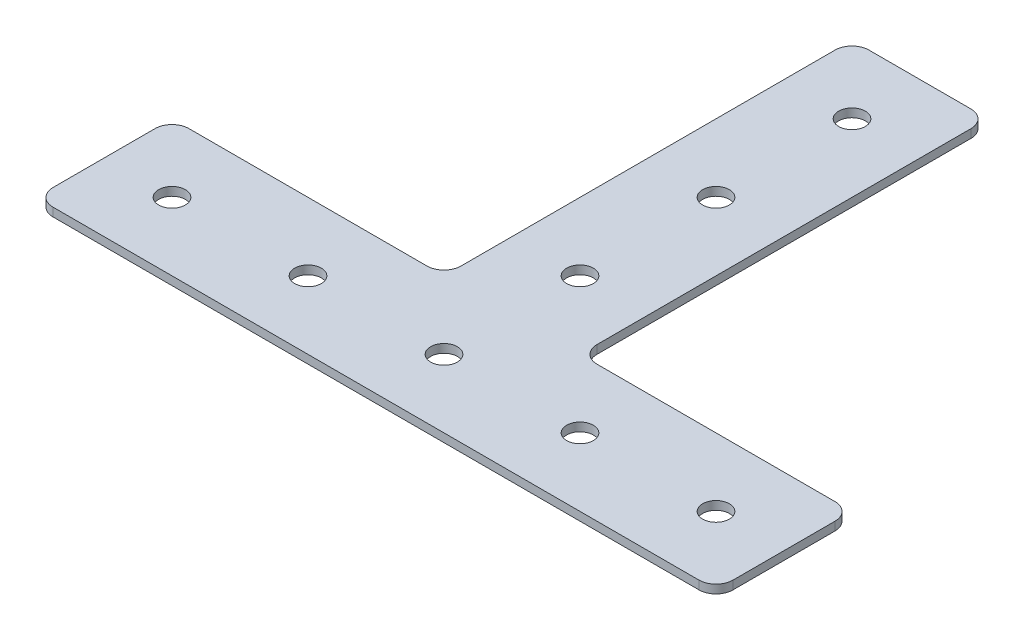
ISO-10303-21;
HEADER;
FILE_DESCRIPTION(('STEP AP214'),'2;1');
FILE_NAME('part.step','',(''),(''),'','','');
FILE_SCHEMA(('AUTOMOTIVE_DESIGN { 1 0 10303 214 1 1 1 1 }'));
ENDSEC;
DATA;
#1=APPLICATION_CONTEXT('core data for automotive mechanical design processes');
#2=APPLICATION_PROTOCOL_DEFINITION('international standard','automotive_design',2000,#1);
#3=PRODUCT_CONTEXT('',#1,'mechanical');
#4=PRODUCT('Part','Part','',(#3));
#5=PRODUCT_RELATED_PRODUCT_CATEGORY('part','',(#4));
#6=PRODUCT_DEFINITION_FORMATION('','',#4);
#7=PRODUCT_DEFINITION_CONTEXT('part definition',#1,'design');
#8=PRODUCT_DEFINITION('design','',#6,#7);
#9=PRODUCT_DEFINITION_SHAPE('','',#8);
#10=(LENGTH_UNIT() NAMED_UNIT(*) SI_UNIT(.MILLI.,.METRE.));
#11=(NAMED_UNIT(*) PLANE_ANGLE_UNIT() SI_UNIT($,.RADIAN.));
#12=(NAMED_UNIT(*) SI_UNIT($,.STERADIAN.) SOLID_ANGLE_UNIT());
#13=UNCERTAINTY_MEASURE_WITH_UNIT(LENGTH_MEASURE(1.E-05),#10,'distance_accuracy_value','');
#14=(GEOMETRIC_REPRESENTATION_CONTEXT(3) GLOBAL_UNCERTAINTY_ASSIGNED_CONTEXT((#13)) GLOBAL_UNIT_ASSIGNED_CONTEXT((#10,
#11,#12)) REPRESENTATION_CONTEXT('',''));
#15=CARTESIAN_POINT('',(0.,0.,0.));
#16=DIRECTION('',(0.,0.,1.));
#17=DIRECTION('',(1.,0.,0.));
#18=AXIS2_PLACEMENT_3D('',#15,#16,#17);
#19=CARTESIAN_POINT('',(63.5,1.5875,12.7));
#20=DIRECTION('',(-1.,0.,0.));
#21=DIRECTION('',(0.,0.,1.));
#22=AXIS2_PLACEMENT_3D('',#19,#20,#21);
#23=PLANE('',#22);
#24=DIRECTION('',(0.,0.,-1.));
#25=VECTOR('',#24,1.);
#26=CARTESIAN_POINT('',(63.5,1.5875,12.7));
#27=LINE('',#26,#25);
#28=CARTESIAN_POINT('',(63.5,1.5875,9.525));
#29=VERTEX_POINT('',#28);
#30=CARTESIAN_POINT('',(63.5,1.5875,-9.525));
#31=VERTEX_POINT('',#30);
#32=EDGE_CURVE('E171',#29,#31,#27,.T.);
#33=ORIENTED_EDGE('',*,*,#32,.F.);
#34=DIRECTION('',(0.,-1.,0.));
#35=VECTOR('',#34,1.);
#36=CARTESIAN_POINT('',(63.5,1.5875,9.525));
#37=LINE('',#36,#35);
#38=CARTESIAN_POINT('',(63.5,0.,9.525));
#39=VERTEX_POINT('',#38);
#40=EDGE_CURVE('E155',#29,#39,#37,.T.);
#41=ORIENTED_EDGE('',*,*,#40,.T.);
#42=DIRECTION('',(0.,0.,-1.));
#43=VECTOR('',#42,1.);
#44=CARTESIAN_POINT('',(63.5,0.,12.7));
#45=LINE('',#44,#43);
#46=CARTESIAN_POINT('',(63.5,0.,-9.525));
#47=VERTEX_POINT('',#46);
#48=EDGE_CURVE('E168',#39,#47,#45,.T.);
#49=ORIENTED_EDGE('',*,*,#48,.T.);
#50=DIRECTION('',(0.,-1.,0.));
#51=VECTOR('',#50,1.);
#52=CARTESIAN_POINT('',(63.5,1.5875,-9.525));
#53=LINE('',#52,#51);
#54=EDGE_CURVE('E174',#47,#31,#53,.F.);
#55=ORIENTED_EDGE('',*,*,#54,.T.);
#56=EDGE_LOOP('',(#33,#41,#49,#55));
#57=FACE_BOUND('',#56,.T.);
#58=ADVANCED_FACE('F36',(#57),#23,.F.);
#59=CARTESIAN_POINT('',(12.7,1.5875,-12.7));
#60=DIRECTION('',(0.,0.,1.));
#61=DIRECTION('',(1.,0.,0.));
#62=AXIS2_PLACEMENT_3D('',#59,#60,#61);
#63=PLANE('',#62);
#64=DIRECTION('',(-1.,0.,0.));
#65=VECTOR('',#64,1.);
#66=CARTESIAN_POINT('',(12.7,0.,-12.7));
#67=LINE('',#66,#65);
#68=CARTESIAN_POINT('',(60.325,0.,-12.7));
#69=VERTEX_POINT('',#68);
#70=CARTESIAN_POINT('',(15.875,0.,-12.7));
#71=VERTEX_POINT('',#70);
#72=EDGE_CURVE('E180',#69,#71,#67,.T.);
#73=ORIENTED_EDGE('',*,*,#72,.T.);
#74=DIRECTION('',(0.,-1.,0.));
#75=VECTOR('',#74,1.);
#76=CARTESIAN_POINT('',(15.875,1.5875,-12.7));
#77=LINE('',#76,#75);
#78=CARTESIAN_POINT('',(15.875,1.5875,-12.7));
#79=VERTEX_POINT('',#78);
#80=EDGE_CURVE('E291',#71,#79,#77,.F.);
#81=ORIENTED_EDGE('',*,*,#80,.T.);
#82=DIRECTION('',(-1.,0.,0.));
#83=VECTOR('',#82,1.);
#84=CARTESIAN_POINT('',(12.7,1.5875,-12.7));
#85=LINE('',#84,#83);
#86=CARTESIAN_POINT('',(60.325,1.5875,-12.7));
#87=VERTEX_POINT('',#86);
#88=EDGE_CURVE('E318',#87,#79,#85,.T.);
#89=ORIENTED_EDGE('',*,*,#88,.F.);
#90=DIRECTION('',(0.,-1.,0.));
#91=VECTOR('',#90,1.);
#92=CARTESIAN_POINT('',(60.325,1.5875,-12.7));
#93=LINE('',#92,#91);
#94=EDGE_CURVE('E287',#87,#69,#93,.T.);
#95=ORIENTED_EDGE('',*,*,#94,.T.);
#96=EDGE_LOOP('',(#73,#81,#89,#95));
#97=FACE_BOUND('',#96,.T.);
#98=ADVANCED_FACE('F306',(#97),#63,.F.);
#99=CARTESIAN_POINT('',(12.7,1.5875,-88.9));
#100=DIRECTION('',(-1.,0.,0.));
#101=DIRECTION('',(0.,0.,1.));
#102=AXIS2_PLACEMENT_3D('',#99,#100,#101);
#103=PLANE('',#102);
#104=DIRECTION('',(0.,0.,-1.));
#105=VECTOR('',#104,1.);
#106=CARTESIAN_POINT('',(12.7,0.,-88.9));
#107=LINE('',#106,#105);
#108=CARTESIAN_POINT('',(12.7,0.,-15.875));
#109=VERTEX_POINT('',#108);
#110=CARTESIAN_POINT('',(12.7,0.,-85.725));
#111=VERTEX_POINT('',#110);
#112=EDGE_CURVE('E187',#109,#111,#107,.T.);
#113=ORIENTED_EDGE('',*,*,#112,.T.);
#114=DIRECTION('',(0.,-1.,0.));
#115=VECTOR('',#114,1.);
#116=CARTESIAN_POINT('',(12.7,1.5875,-85.725));
#117=LINE('',#116,#115);
#118=CARTESIAN_POINT('',(12.7,1.5875,-85.725));
#119=VERTEX_POINT('',#118);
#120=EDGE_CURVE('E284',#111,#119,#117,.F.);
#121=ORIENTED_EDGE('',*,*,#120,.T.);
#122=DIRECTION('',(0.,0.,-1.));
#123=VECTOR('',#122,1.);
#124=CARTESIAN_POINT('',(12.7,1.5875,-88.9));
#125=LINE('',#124,#123);
#126=CARTESIAN_POINT('',(12.7,1.5875,-15.875));
#127=VERTEX_POINT('',#126);
#128=EDGE_CURVE('E316',#127,#119,#125,.T.);
#129=ORIENTED_EDGE('',*,*,#128,.F.);
#130=DIRECTION('',(0.,-1.,0.));
#131=VECTOR('',#130,1.);
#132=CARTESIAN_POINT('',(12.7,0.,-15.875));
#133=LINE('',#132,#131);
#134=EDGE_CURVE('E280',#127,#109,#133,.T.);
#135=ORIENTED_EDGE('',*,*,#134,.T.);
#136=EDGE_LOOP('',(#113,#121,#129,#135));
#137=FACE_BOUND('',#136,.T.);
#138=ADVANCED_FACE('F320',(#137),#103,.F.);
#139=CARTESIAN_POINT('',(-12.7,1.5875,-88.9));
#140=DIRECTION('',(0.,0.,1.));
#141=DIRECTION('',(1.,0.,0.));
#142=AXIS2_PLACEMENT_3D('',#139,#140,#141);
#143=PLANE('',#142);
#144=DIRECTION('',(-1.,0.,0.));
#145=VECTOR('',#144,1.);
#146=CARTESIAN_POINT('',(-12.7,0.,-88.9));
#147=LINE('',#146,#145);
#148=CARTESIAN_POINT('',(9.52499999999999,0.,-88.9));
#149=VERTEX_POINT('',#148);
#150=CARTESIAN_POINT('',(-9.52500000000001,0.,-88.9));
#151=VERTEX_POINT('',#150);
#152=EDGE_CURVE('E199',#149,#151,#147,.T.);
#153=ORIENTED_EDGE('',*,*,#152,.T.);
#154=DIRECTION('',(0.,-1.,0.));
#155=VECTOR('',#154,1.);
#156=CARTESIAN_POINT('',(-9.52500000000001,1.5875,-88.9));
#157=LINE('',#156,#155);
#158=CARTESIAN_POINT('',(-9.52500000000001,1.5875,-88.9));
#159=VERTEX_POINT('',#158);
#160=EDGE_CURVE('E277',#151,#159,#157,.F.);
#161=ORIENTED_EDGE('',*,*,#160,.T.);
#162=DIRECTION('',(-1.,0.,0.));
#163=VECTOR('',#162,1.);
#164=CARTESIAN_POINT('',(-12.7,1.5875,-88.9));
#165=LINE('',#164,#163);
#166=CARTESIAN_POINT('',(9.52499999999999,1.5875,-88.9));
#167=VERTEX_POINT('',#166);
#168=EDGE_CURVE('E323',#167,#159,#165,.T.);
#169=ORIENTED_EDGE('',*,*,#168,.F.);
#170=DIRECTION('',(0.,-1.,0.));
#171=VECTOR('',#170,1.);
#172=CARTESIAN_POINT('',(9.52499999999999,1.5875,-88.9));
#173=LINE('',#172,#171);
#174=EDGE_CURVE('E273',#167,#149,#173,.T.);
#175=ORIENTED_EDGE('',*,*,#174,.T.);
#176=EDGE_LOOP('',(#153,#161,#169,#175));
#177=FACE_BOUND('',#176,.T.);
#178=ADVANCED_FACE('F376',(#177),#143,.F.);
#179=CARTESIAN_POINT('',(-12.7,1.5875,-88.9));
#180=DIRECTION('',(1.,0.,0.));
#181=DIRECTION('',(0.,0.,-1.));
#182=AXIS2_PLACEMENT_3D('',#179,#180,#181);
#183=PLANE('',#182);
#184=DIRECTION('',(0.,0.,1.));
#185=VECTOR('',#184,1.);
#186=CARTESIAN_POINT('',(-12.7,0.,-88.9));
#187=LINE('',#186,#185);
#188=CARTESIAN_POINT('',(-12.7,0.,-85.725));
#189=VERTEX_POINT('',#188);
#190=CARTESIAN_POINT('',(-12.7,0.,-15.875));
#191=VERTEX_POINT('',#190);
#192=EDGE_CURVE('E203',#189,#191,#187,.T.);
#193=ORIENTED_EDGE('',*,*,#192,.T.);
#194=DIRECTION('',(0.,-1.,0.));
#195=VECTOR('',#194,1.);
#196=CARTESIAN_POINT('',(-12.7,1.5875,-15.875));
#197=LINE('',#196,#195);
#198=CARTESIAN_POINT('',(-12.7,1.5875,-15.875));
#199=VERTEX_POINT('',#198);
#200=EDGE_CURVE('E270',#191,#199,#197,.F.);
#201=ORIENTED_EDGE('',*,*,#200,.T.);
#202=DIRECTION('',(0.,0.,1.));
#203=VECTOR('',#202,1.);
#204=CARTESIAN_POINT('',(-12.7,1.5875,-88.9));
#205=LINE('',#204,#203);
#206=CARTESIAN_POINT('',(-12.7,1.5875,-85.725));
#207=VERTEX_POINT('',#206);
#208=EDGE_CURVE('E329',#207,#199,#205,.T.);
#209=ORIENTED_EDGE('',*,*,#208,.F.);
#210=DIRECTION('',(0.,-1.,0.));
#211=VECTOR('',#210,1.);
#212=CARTESIAN_POINT('',(-12.7,1.5875,-85.725));
#213=LINE('',#212,#211);
#214=EDGE_CURVE('E266',#207,#189,#213,.T.);
#215=ORIENTED_EDGE('',*,*,#214,.T.);
#216=EDGE_LOOP('',(#193,#201,#209,#215));
#217=FACE_BOUND('',#216,.T.);
#218=ADVANCED_FACE('F367',(#217),#183,.F.);
#219=CARTESIAN_POINT('',(-63.5,1.5875,-12.7));
#220=DIRECTION('',(0.,0.,1.));
#221=DIRECTION('',(1.,0.,0.));
#222=AXIS2_PLACEMENT_3D('',#219,#220,#221);
#223=PLANE('',#222);
#224=DIRECTION('',(-1.,0.,0.));
#225=VECTOR('',#224,1.);
#226=CARTESIAN_POINT('',(-63.5,1.5875,-12.7));
#227=LINE('',#226,#225);
#228=CARTESIAN_POINT('',(-15.875,1.5875,-12.7));
#229=VERTEX_POINT('',#228);
#230=CARTESIAN_POINT('',(-60.325,1.5875,-12.7));
#231=VERTEX_POINT('',#230);
#232=EDGE_CURVE('E337',#229,#231,#227,.T.);
#233=ORIENTED_EDGE('',*,*,#232,.F.);
#234=DIRECTION('',(0.,-1.,0.));
#235=VECTOR('',#234,1.);
#236=CARTESIAN_POINT('',(-15.875,0.,-12.7));
#237=LINE('',#236,#235);
#238=CARTESIAN_POINT('',(-15.875,0.,-12.7));
#239=VERTEX_POINT('',#238);
#240=EDGE_CURVE('E262',#229,#239,#237,.T.);
#241=ORIENTED_EDGE('',*,*,#240,.T.);
#242=DIRECTION('',(-1.,0.,0.));
#243=VECTOR('',#242,1.);
#244=CARTESIAN_POINT('',(-63.5,0.,-12.7));
#245=LINE('',#244,#243);
#246=CARTESIAN_POINT('',(-60.325,0.,-12.7));
#247=VERTEX_POINT('',#246);
#248=EDGE_CURVE('E207',#239,#247,#245,.T.);
#249=ORIENTED_EDGE('',*,*,#248,.T.);
#250=DIRECTION('',(0.,-1.,0.));
#251=VECTOR('',#250,1.);
#252=CARTESIAN_POINT('',(-60.325,1.5875,-12.7));
#253=LINE('',#252,#251);
#254=EDGE_CURVE('E259',#247,#231,#253,.F.);
#255=ORIENTED_EDGE('',*,*,#254,.T.);
#256=EDGE_LOOP('',(#233,#241,#249,#255));
#257=FACE_BOUND('',#256,.T.);
#258=ADVANCED_FACE('F359',(#257),#223,.F.);
#259=CARTESIAN_POINT('',(-63.5,1.5875,12.7));
#260=DIRECTION('',(1.,0.,0.));
#261=DIRECTION('',(0.,0.,-1.));
#262=AXIS2_PLACEMENT_3D('',#259,#260,#261);
#263=PLANE('',#262);
#264=DIRECTION('',(0.,0.,1.));
#265=VECTOR('',#264,1.);
#266=CARTESIAN_POINT('',(-63.5,0.,12.7));
#267=LINE('',#266,#265);
#268=CARTESIAN_POINT('',(-63.5,0.,-9.525));
#269=VERTEX_POINT('',#268);
#270=CARTESIAN_POINT('',(-63.5,0.,9.525));
#271=VERTEX_POINT('',#270);
#272=EDGE_CURVE('E211',#269,#271,#267,.T.);
#273=ORIENTED_EDGE('',*,*,#272,.T.);
#274=DIRECTION('',(0.,-1.,0.));
#275=VECTOR('',#274,1.);
#276=CARTESIAN_POINT('',(-63.5,1.5875,9.525));
#277=LINE('',#276,#275);
#278=CARTESIAN_POINT('',(-63.5,1.5875,9.525));
#279=VERTEX_POINT('',#278);
#280=EDGE_CURVE('E52',#271,#279,#277,.F.);
#281=ORIENTED_EDGE('',*,*,#280,.T.);
#282=DIRECTION('',(0.,0.,1.));
#283=VECTOR('',#282,1.);
#284=CARTESIAN_POINT('',(-63.5,1.5875,12.7));
#285=LINE('',#284,#283);
#286=CARTESIAN_POINT('',(-63.5,1.5875,-9.525));
#287=VERTEX_POINT('',#286);
#288=EDGE_CURVE('E339',#287,#279,#285,.T.);
#289=ORIENTED_EDGE('',*,*,#288,.F.);
#290=DIRECTION('',(0.,-1.,0.));
#291=VECTOR('',#290,1.);
#292=CARTESIAN_POINT('',(-63.5,1.5875,-9.525));
#293=LINE('',#292,#291);
#294=EDGE_CURVE('E253',#287,#269,#293,.T.);
#295=ORIENTED_EDGE('',*,*,#294,.T.);
#296=EDGE_LOOP('',(#273,#281,#289,#295));
#297=FACE_BOUND('',#296,.T.);
#298=ADVANCED_FACE('F352',(#297),#263,.F.);
#299=CARTESIAN_POINT('',(-63.5,1.5875,12.7));
#300=DIRECTION('',(0.,0.,-1.));
#301=DIRECTION('',(-1.,0.,0.));
#302=AXIS2_PLACEMENT_3D('',#299,#300,#301);
#303=PLANE('',#302);
#304=DIRECTION('',(1.,0.,0.));
#305=VECTOR('',#304,1.);
#306=CARTESIAN_POINT('',(-63.5,0.,12.7));
#307=LINE('',#306,#305);
#308=CARTESIAN_POINT('',(-60.325,0.,12.7));
#309=VERTEX_POINT('',#308);
#310=CARTESIAN_POINT('',(60.325,0.,12.7));
#311=VERTEX_POINT('',#310);
#312=EDGE_CURVE('E214',#309,#311,#307,.T.);
#313=ORIENTED_EDGE('',*,*,#312,.T.);
#314=DIRECTION('',(0.,-1.,0.));
#315=VECTOR('',#314,1.);
#316=CARTESIAN_POINT('',(60.325,1.5875,12.7));
#317=LINE('',#316,#315);
#318=CARTESIAN_POINT('',(60.325,1.5875,12.7));
#319=VERTEX_POINT('',#318);
#320=EDGE_CURVE('E156',#311,#319,#317,.F.);
#321=ORIENTED_EDGE('',*,*,#320,.T.);
#322=DIRECTION('',(1.,0.,0.));
#323=VECTOR('',#322,1.);
#324=CARTESIAN_POINT('',(-63.5,1.5875,12.7));
#325=LINE('',#324,#323);
#326=CARTESIAN_POINT('',(-60.325,1.5875,12.7));
#327=VERTEX_POINT('',#326);
#328=EDGE_CURVE('E193',#327,#319,#325,.T.);
#329=ORIENTED_EDGE('',*,*,#328,.F.);
#330=DIRECTION('',(0.,-1.,0.));
#331=VECTOR('',#330,1.);
#332=CARTESIAN_POINT('',(-60.325,1.5875,12.7));
#333=LINE('',#332,#331);
#334=EDGE_CURVE('E162',#327,#309,#333,.T.);
#335=ORIENTED_EDGE('',*,*,#334,.T.);
#336=EDGE_LOOP('',(#313,#321,#329,#335));
#337=FACE_BOUND('',#336,.T.);
#338=ADVANCED_FACE('F348',(#337),#303,.F.);
#339=CARTESIAN_POINT('',(0.,1.5875,0.));
#340=DIRECTION('',(0.,-1.,0.));
#341=DIRECTION('',(0.,0.,-1.));
#342=AXIS2_PLACEMENT_3D('',#339,#340,#341);
#343=PLANE('',#342);
#344=CARTESIAN_POINT('',(-25.4,1.5875,0.));
#345=DIRECTION('',(0.,-1.,0.));
#346=DIRECTION('',(0.,0.,-1.));
#347=AXIS2_PLACEMENT_3D('',#344,#345,#346);
#348=CIRCLE('',#347,2.4892);
#349=CARTESIAN_POINT('',(-25.4,1.5875,-2.4892));
#350=VERTEX_POINT('',#349);
#351=EDGE_CURVE('E181',#350,#350,#348,.T.);
#352=ORIENTED_EDGE('',*,*,#351,.T.);
#353=EDGE_LOOP('',(#352));
#354=FACE_BOUND('',#353,.T.);
#355=CARTESIAN_POINT('',(0.,1.5875,-76.2));
#356=DIRECTION('',(0.,-1.,0.));
#357=DIRECTION('',(0.,0.,-1.));
#358=AXIS2_PLACEMENT_3D('',#355,#356,#357);
#359=CIRCLE('',#358,2.4892);
#360=CARTESIAN_POINT('',(0.,1.5875,-78.6892));
#361=VERTEX_POINT('',#360);
#362=EDGE_CURVE('E190',#361,#361,#359,.T.);
#363=ORIENTED_EDGE('',*,*,#362,.T.);
#364=EDGE_LOOP('',(#363));
#365=FACE_BOUND('',#364,.T.);
#366=CARTESIAN_POINT('',(0.,1.5875,-50.8));
#367=DIRECTION('',(0.,-1.,0.));
#368=DIRECTION('',(0.,0.,-1.));
#369=AXIS2_PLACEMENT_3D('',#366,#367,#368);
#370=CIRCLE('',#369,2.4892);
#371=CARTESIAN_POINT('',(0.,1.5875,-53.2892));
#372=VERTEX_POINT('',#371);
#373=EDGE_CURVE('E667',#372,#372,#370,.T.);
#374=ORIENTED_EDGE('',*,*,#373,.T.);
#375=EDGE_LOOP('',(#374));
#376=FACE_BOUND('',#375,.T.);
#377=CARTESIAN_POINT('',(0.,1.5875,-25.4));
#378=DIRECTION('',(0.,-1.,0.));
#379=DIRECTION('',(0.,0.,-1.));
#380=AXIS2_PLACEMENT_3D('',#377,#378,#379);
#381=CIRCLE('',#380,2.4892);
#382=CARTESIAN_POINT('',(0.,1.5875,-27.8892));
#383=VERTEX_POINT('',#382);
#384=EDGE_CURVE('E671',#383,#383,#381,.T.);
#385=ORIENTED_EDGE('',*,*,#384,.T.);
#386=EDGE_LOOP('',(#385));
#387=FACE_BOUND('',#386,.T.);
#388=CARTESIAN_POINT('',(-50.8,1.5875,0.));
#389=DIRECTION('',(0.,-1.,0.));
#390=DIRECTION('',(0.,0.,-1.));
#391=AXIS2_PLACEMENT_3D('',#388,#389,#390);
#392=CIRCLE('',#391,2.4892);
#393=CARTESIAN_POINT('',(-50.8,1.5875,-2.48919999999999));
#394=VERTEX_POINT('',#393);
#395=EDGE_CURVE('E675',#394,#394,#392,.T.);
#396=ORIENTED_EDGE('',*,*,#395,.T.);
#397=EDGE_LOOP('',(#396));
#398=FACE_BOUND('',#397,.T.);
#399=CARTESIAN_POINT('',(25.4,1.5875,0.));
#400=DIRECTION('',(0.,-1.,0.));
#401=DIRECTION('',(0.,0.,-1.));
#402=AXIS2_PLACEMENT_3D('',#399,#400,#401);
#403=CIRCLE('',#402,2.4892);
#404=CARTESIAN_POINT('',(25.4,1.5875,-2.4892));
#405=VERTEX_POINT('',#404);
#406=EDGE_CURVE('E679',#405,#405,#403,.T.);
#407=ORIENTED_EDGE('',*,*,#406,.T.);
#408=EDGE_LOOP('',(#407));
#409=FACE_BOUND('',#408,.T.);
#410=CARTESIAN_POINT('',(50.8,1.5875,0.));
#411=DIRECTION('',(0.,-1.,0.));
#412=DIRECTION('',(0.,0.,-1.));
#413=AXIS2_PLACEMENT_3D('',#410,#411,#412);
#414=CIRCLE('',#413,2.4892);
#415=CARTESIAN_POINT('',(50.8,1.5875,-2.4892));
#416=VERTEX_POINT('',#415);
#417=EDGE_CURVE('E683',#416,#416,#414,.T.);
#418=ORIENTED_EDGE('',*,*,#417,.T.);
#419=EDGE_LOOP('',(#418));
#420=FACE_BOUND('',#419,.T.);
#421=CARTESIAN_POINT('',(0.,1.5875,0.));
#422=DIRECTION('',(0.,-1.,0.));
#423=DIRECTION('',(0.,0.,-1.));
#424=AXIS2_PLACEMENT_3D('',#421,#422,#423);
#425=CIRCLE('',#424,2.4892);
#426=CARTESIAN_POINT('',(0.,1.5875,-2.4892));
#427=VERTEX_POINT('',#426);
#428=EDGE_CURVE('E686',#427,#427,#425,.T.);
#429=ORIENTED_EDGE('',*,*,#428,.T.);
#430=EDGE_LOOP('',(#429));
#431=FACE_BOUND('',#430,.T.);
#432=ORIENTED_EDGE('',*,*,#328,.T.);
#433=CARTESIAN_POINT('',(60.325,1.5875,9.525));
#434=DIRECTION('',(0.,-1.,0.));
#435=DIRECTION('',(0.,0.,-1.));
#436=AXIS2_PLACEMENT_3D('',#433,#434,#435);
#437=CIRCLE('',#436,3.175);
#438=EDGE_CURVE('E250',#319,#29,#437,.F.);
#439=ORIENTED_EDGE('',*,*,#438,.T.);
#440=ORIENTED_EDGE('',*,*,#32,.T.);
#441=CARTESIAN_POINT('',(60.325,1.5875,-9.525));
#442=DIRECTION('',(0.,-1.,0.));
#443=DIRECTION('',(0.,0.,-1.));
#444=AXIS2_PLACEMENT_3D('',#441,#442,#443);
#445=CIRCLE('',#444,3.175);
#446=EDGE_CURVE('E238',#31,#87,#445,.F.);
#447=ORIENTED_EDGE('',*,*,#446,.T.);
#448=ORIENTED_EDGE('',*,*,#88,.T.);
#449=CARTESIAN_POINT('',(15.875,1.5875,-15.875));
#450=DIRECTION('',(0.,-1.,0.));
#451=DIRECTION('',(0.,0.,-1.));
#452=AXIS2_PLACEMENT_3D('',#449,#450,#451);
#453=CIRCLE('',#452,3.175);
#454=EDGE_CURVE('E11',#79,#127,#453,.T.);
#455=ORIENTED_EDGE('',*,*,#454,.T.);
#456=ORIENTED_EDGE('',*,*,#128,.T.);
#457=CARTESIAN_POINT('',(9.52499999999999,1.5875,-85.725));
#458=DIRECTION('',(0.,-1.,0.));
#459=DIRECTION('',(0.,0.,-1.));
#460=AXIS2_PLACEMENT_3D('',#457,#458,#459);
#461=CIRCLE('',#460,3.175);
#462=EDGE_CURVE('E241',#119,#167,#461,.F.);
#463=ORIENTED_EDGE('',*,*,#462,.T.);
#464=ORIENTED_EDGE('',*,*,#168,.T.);
#465=CARTESIAN_POINT('',(-9.52500000000001,1.5875,-85.725));
#466=DIRECTION('',(0.,-1.,0.));
#467=DIRECTION('',(0.,0.,-1.));
#468=AXIS2_PLACEMENT_3D('',#465,#466,#467);
#469=CIRCLE('',#468,3.175);
#470=EDGE_CURVE('E244',#159,#207,#469,.F.);
#471=ORIENTED_EDGE('',*,*,#470,.T.);
#472=ORIENTED_EDGE('',*,*,#208,.T.);
#473=CARTESIAN_POINT('',(-15.875,1.5875,-15.875));
#474=DIRECTION('',(0.,-1.,0.));
#475=DIRECTION('',(0.,0.,-1.));
#476=AXIS2_PLACEMENT_3D('',#473,#474,#475);
#477=CIRCLE('',#476,3.175);
#478=EDGE_CURVE('E297',#199,#229,#477,.T.);
#479=ORIENTED_EDGE('',*,*,#478,.T.);
#480=ORIENTED_EDGE('',*,*,#232,.T.);
#481=CARTESIAN_POINT('',(-60.325,1.5875,-9.525));
#482=DIRECTION('',(0.,-1.,0.));
#483=DIRECTION('',(0.,0.,-1.));
#484=AXIS2_PLACEMENT_3D('',#481,#482,#483);
#485=CIRCLE('',#484,3.175);
#486=EDGE_CURVE('E59',#231,#287,#485,.F.);
#487=ORIENTED_EDGE('',*,*,#486,.T.);
#488=ORIENTED_EDGE('',*,*,#288,.T.);
#489=CARTESIAN_POINT('',(-60.325,1.5875,9.525));
#490=DIRECTION('',(0.,-1.,0.));
#491=DIRECTION('',(0.,0.,-1.));
#492=AXIS2_PLACEMENT_3D('',#489,#490,#491);
#493=CIRCLE('',#492,3.175);
#494=EDGE_CURVE('E247',#279,#327,#493,.F.);
#495=ORIENTED_EDGE('',*,*,#494,.T.);
#496=EDGE_LOOP('',(#432,#439,#440,#447,#448,#455,#456,#463,#464,#471,#472,#479,#480,#487,#488,#495));
#497=FACE_BOUND('',#496,.T.);
#498=ADVANCED_FACE('F315',(#354,#365,#376,#387,#398,#409,#420,#431,#497),#343,.F.);
#499=CARTESIAN_POINT('',(0.,0.,0.));
#500=DIRECTION('',(0.,-1.,0.));
#501=DIRECTION('',(0.,0.,-1.));
#502=AXIS2_PLACEMENT_3D('',#499,#500,#501);
#503=PLANE('',#502);
#504=CARTESIAN_POINT('',(-25.4,0.,0.));
#505=DIRECTION('',(0.,1.,0.));
#506=DIRECTION('',(0.,0.,1.));
#507=AXIS2_PLACEMENT_3D('',#504,#505,#506);
#508=CIRCLE('',#507,2.4892);
#509=CARTESIAN_POINT('',(-25.4,0.,2.4892));
#510=VERTEX_POINT('',#509);
#511=EDGE_CURVE('E735',#510,#510,#508,.T.);
#512=ORIENTED_EDGE('',*,*,#511,.T.);
#513=EDGE_LOOP('',(#512));
#514=FACE_BOUND('',#513,.T.);
#515=CARTESIAN_POINT('',(0.,0.,-76.2));
#516=DIRECTION('',(0.,1.,0.));
#517=DIRECTION('',(0.,0.,1.));
#518=AXIS2_PLACEMENT_3D('',#515,#516,#517);
#519=CIRCLE('',#518,2.4892);
#520=CARTESIAN_POINT('',(0.,0.,-73.7108));
#521=VERTEX_POINT('',#520);
#522=EDGE_CURVE('E731',#521,#521,#519,.T.);
#523=ORIENTED_EDGE('',*,*,#522,.T.);
#524=EDGE_LOOP('',(#523));
#525=FACE_BOUND('',#524,.T.);
#526=CARTESIAN_POINT('',(0.,0.,-50.8));
#527=DIRECTION('',(0.,1.,0.));
#528=DIRECTION('',(0.,0.,1.));
#529=AXIS2_PLACEMENT_3D('',#526,#527,#528);
#530=CIRCLE('',#529,2.4892);
#531=CARTESIAN_POINT('',(0.,0.,-48.3108));
#532=VERTEX_POINT('',#531);
#533=EDGE_CURVE('E727',#532,#532,#530,.T.);
#534=ORIENTED_EDGE('',*,*,#533,.T.);
#535=EDGE_LOOP('',(#534));
#536=FACE_BOUND('',#535,.T.);
#537=CARTESIAN_POINT('',(0.,0.,-25.4));
#538=DIRECTION('',(0.,1.,0.));
#539=DIRECTION('',(0.,0.,1.));
#540=AXIS2_PLACEMENT_3D('',#537,#538,#539);
#541=CIRCLE('',#540,2.4892);
#542=CARTESIAN_POINT('',(0.,0.,-22.9108));
#543=VERTEX_POINT('',#542);
#544=EDGE_CURVE('E696',#543,#543,#541,.T.);
#545=ORIENTED_EDGE('',*,*,#544,.T.);
#546=EDGE_LOOP('',(#545));
#547=FACE_BOUND('',#546,.T.);
#548=CARTESIAN_POINT('',(-50.8,0.,0.));
#549=DIRECTION('',(0.,1.,0.));
#550=DIRECTION('',(0.,0.,1.));
#551=AXIS2_PLACEMENT_3D('',#548,#549,#550);
#552=CIRCLE('',#551,2.4892);
#553=CARTESIAN_POINT('',(-50.8,0.,2.4892));
#554=VERTEX_POINT('',#553);
#555=EDGE_CURVE('E739',#554,#554,#552,.T.);
#556=ORIENTED_EDGE('',*,*,#555,.T.);
#557=EDGE_LOOP('',(#556));
#558=FACE_BOUND('',#557,.T.);
#559=CARTESIAN_POINT('',(25.4,0.,0.));
#560=DIRECTION('',(0.,1.,0.));
#561=DIRECTION('',(0.,0.,1.));
#562=AXIS2_PLACEMENT_3D('',#559,#560,#561);
#563=CIRCLE('',#562,2.4892);
#564=CARTESIAN_POINT('',(25.4,0.,2.4892));
#565=VERTEX_POINT('',#564);
#566=EDGE_CURVE('E747',#565,#565,#563,.T.);
#567=ORIENTED_EDGE('',*,*,#566,.T.);
#568=EDGE_LOOP('',(#567));
#569=FACE_BOUND('',#568,.T.);
#570=CARTESIAN_POINT('',(50.8,0.,0.));
#571=DIRECTION('',(0.,1.,0.));
#572=DIRECTION('',(0.,0.,1.));
#573=AXIS2_PLACEMENT_3D('',#570,#571,#572);
#574=CIRCLE('',#573,2.4892);
#575=CARTESIAN_POINT('',(50.8,0.,2.4892));
#576=VERTEX_POINT('',#575);
#577=EDGE_CURVE('E743',#576,#576,#574,.T.);
#578=ORIENTED_EDGE('',*,*,#577,.T.);
#579=EDGE_LOOP('',(#578));
#580=FACE_BOUND('',#579,.T.);
#581=CARTESIAN_POINT('',(0.,0.,0.));
#582=DIRECTION('',(0.,1.,0.));
#583=DIRECTION('',(0.,0.,1.));
#584=AXIS2_PLACEMENT_3D('',#581,#582,#583);
#585=CIRCLE('',#584,2.4892);
#586=CARTESIAN_POINT('',(0.,0.,2.4892));
#587=VERTEX_POINT('',#586);
#588=EDGE_CURVE('E689',#587,#587,#585,.T.);
#589=ORIENTED_EDGE('',*,*,#588,.T.);
#590=EDGE_LOOP('',(#589));
#591=FACE_BOUND('',#590,.T.);
#592=ORIENTED_EDGE('',*,*,#48,.F.);
#593=CARTESIAN_POINT('',(60.325,0.,9.525));
#594=DIRECTION('',(0.,-1.,0.));
#595=DIRECTION('',(0.,0.,-1.));
#596=AXIS2_PLACEMENT_3D('',#593,#594,#595);
#597=CIRCLE('',#596,3.175);
#598=EDGE_CURVE('E151',#39,#311,#597,.T.);
#599=ORIENTED_EDGE('',*,*,#598,.T.);
#600=ORIENTED_EDGE('',*,*,#312,.F.);
#601=CARTESIAN_POINT('',(-60.325,0.,9.525));
#602=DIRECTION('',(0.,-1.,0.));
#603=DIRECTION('',(0.,0.,-1.));
#604=AXIS2_PLACEMENT_3D('',#601,#602,#603);
#605=CIRCLE('',#604,3.175);
#606=EDGE_CURVE('E163',#309,#271,#605,.T.);
#607=ORIENTED_EDGE('',*,*,#606,.T.);
#608=ORIENTED_EDGE('',*,*,#272,.F.);
#609=CARTESIAN_POINT('',(-60.325,0.,-9.525));
#610=DIRECTION('',(0.,-1.,0.));
#611=DIRECTION('',(0.,0.,-1.));
#612=AXIS2_PLACEMENT_3D('',#609,#610,#611);
#613=CIRCLE('',#612,3.175);
#614=EDGE_CURVE('E173',#269,#247,#613,.T.);
#615=ORIENTED_EDGE('',*,*,#614,.T.);
#616=ORIENTED_EDGE('',*,*,#248,.F.);
#617=CARTESIAN_POINT('',(-15.875,0.,-15.875));
#618=DIRECTION('',(0.,-1.,0.));
#619=DIRECTION('',(0.,0.,-1.));
#620=AXIS2_PLACEMENT_3D('',#617,#618,#619);
#621=CIRCLE('',#620,3.175);
#622=EDGE_CURVE('E294',#239,#191,#621,.F.);
#623=ORIENTED_EDGE('',*,*,#622,.T.);
#624=ORIENTED_EDGE('',*,*,#192,.F.);
#625=CARTESIAN_POINT('',(-9.52500000000001,0.,-85.725));
#626=DIRECTION('',(0.,-1.,0.));
#627=DIRECTION('',(0.,0.,-1.));
#628=AXIS2_PLACEMENT_3D('',#625,#626,#627);
#629=CIRCLE('',#628,3.175);
#630=EDGE_CURVE('E226',#189,#151,#629,.T.);
#631=ORIENTED_EDGE('',*,*,#630,.T.);
#632=ORIENTED_EDGE('',*,*,#152,.F.);
#633=CARTESIAN_POINT('',(9.52499999999999,0.,-85.725));
#634=DIRECTION('',(0.,-1.,0.));
#635=DIRECTION('',(0.,0.,-1.));
#636=AXIS2_PLACEMENT_3D('',#633,#634,#635);
#637=CIRCLE('',#636,3.175);
#638=EDGE_CURVE('E223',#149,#111,#637,.T.);
#639=ORIENTED_EDGE('',*,*,#638,.T.);
#640=ORIENTED_EDGE('',*,*,#112,.F.);
#641=CARTESIAN_POINT('',(15.875,0.,-15.875));
#642=DIRECTION('',(0.,-1.,0.));
#643=DIRECTION('',(0.,0.,-1.));
#644=AXIS2_PLACEMENT_3D('',#641,#642,#643);
#645=CIRCLE('',#644,3.175);
#646=EDGE_CURVE('E45',#109,#71,#645,.F.);
#647=ORIENTED_EDGE('',*,*,#646,.T.);
#648=ORIENTED_EDGE('',*,*,#72,.F.);
#649=CARTESIAN_POINT('',(60.325,0.,-9.525));
#650=DIRECTION('',(0.,-1.,0.));
#651=DIRECTION('',(0.,0.,-1.));
#652=AXIS2_PLACEMENT_3D('',#649,#650,#651);
#653=CIRCLE('',#652,3.175);
#654=EDGE_CURVE('E178',#69,#47,#653,.T.);
#655=ORIENTED_EDGE('',*,*,#654,.T.);
#656=EDGE_LOOP('',(#592,#599,#600,#607,#608,#615,#616,#623,#624,#631,#632,#639,#640,#647,#648,#655));
#657=FACE_BOUND('',#656,.T.);
#658=ADVANCED_FACE('F176',(#514,#525,#536,#547,#558,#569,#580,#591,#657),#503,.T.);
#659=CARTESIAN_POINT('',(0.,0.,0.));
#660=DIRECTION('',(0.,1.,0.));
#661=DIRECTION('',(0.,0.,1.));
#662=AXIS2_PLACEMENT_3D('',#659,#660,#661);
#663=CYLINDRICAL_SURFACE('',#662,2.4892);
#664=ORIENTED_EDGE('',*,*,#588,.F.);
#665=EDGE_LOOP('',(#664));
#666=FACE_BOUND('',#665,.T.);
#667=ORIENTED_EDGE('',*,*,#428,.F.);
#668=EDGE_LOOP('',(#667));
#669=FACE_BOUND('',#668,.T.);
#670=ADVANCED_FACE('F533',(#666,#669),#663,.F.);
#671=CARTESIAN_POINT('',(50.8,0.,0.));
#672=DIRECTION('',(0.,1.,0.));
#673=DIRECTION('',(0.,0.,1.));
#674=AXIS2_PLACEMENT_3D('',#671,#672,#673);
#675=CYLINDRICAL_SURFACE('',#674,2.4892);
#676=ORIENTED_EDGE('',*,*,#577,.F.);
#677=EDGE_LOOP('',(#676));
#678=FACE_BOUND('',#677,.T.);
#679=ORIENTED_EDGE('',*,*,#417,.F.);
#680=EDGE_LOOP('',(#679));
#681=FACE_BOUND('',#680,.T.);
#682=ADVANCED_FACE('F523',(#678,#681),#675,.F.);
#683=CARTESIAN_POINT('',(25.4,0.,0.));
#684=DIRECTION('',(0.,1.,0.));
#685=DIRECTION('',(0.,0.,1.));
#686=AXIS2_PLACEMENT_3D('',#683,#684,#685);
#687=CYLINDRICAL_SURFACE('',#686,2.4892);
#688=ORIENTED_EDGE('',*,*,#566,.F.);
#689=EDGE_LOOP('',(#688));
#690=FACE_BOUND('',#689,.T.);
#691=ORIENTED_EDGE('',*,*,#406,.F.);
#692=EDGE_LOOP('',(#691));
#693=FACE_BOUND('',#692,.T.);
#694=ADVANCED_FACE('F513',(#690,#693),#687,.F.);
#695=CARTESIAN_POINT('',(-50.8,0.,0.));
#696=DIRECTION('',(0.,1.,0.));
#697=DIRECTION('',(0.,0.,1.));
#698=AXIS2_PLACEMENT_3D('',#695,#696,#697);
#699=CYLINDRICAL_SURFACE('',#698,2.4892);
#700=ORIENTED_EDGE('',*,*,#555,.F.);
#701=EDGE_LOOP('',(#700));
#702=FACE_BOUND('',#701,.T.);
#703=ORIENTED_EDGE('',*,*,#395,.F.);
#704=EDGE_LOOP('',(#703));
#705=FACE_BOUND('',#704,.T.);
#706=ADVANCED_FACE('F503',(#702,#705),#699,.F.);
#707=CARTESIAN_POINT('',(0.,0.,-25.4));
#708=DIRECTION('',(0.,1.,0.));
#709=DIRECTION('',(0.,0.,1.));
#710=AXIS2_PLACEMENT_3D('',#707,#708,#709);
#711=CYLINDRICAL_SURFACE('',#710,2.4892);
#712=ORIENTED_EDGE('',*,*,#544,.F.);
#713=EDGE_LOOP('',(#712));
#714=FACE_BOUND('',#713,.T.);
#715=ORIENTED_EDGE('',*,*,#384,.F.);
#716=EDGE_LOOP('',(#715));
#717=FACE_BOUND('',#716,.T.);
#718=ADVANCED_FACE('F493',(#714,#717),#711,.F.);
#719=CARTESIAN_POINT('',(0.,0.,-50.8));
#720=DIRECTION('',(0.,1.,0.));
#721=DIRECTION('',(0.,0.,1.));
#722=AXIS2_PLACEMENT_3D('',#719,#720,#721);
#723=CYLINDRICAL_SURFACE('',#722,2.4892);
#724=ORIENTED_EDGE('',*,*,#533,.F.);
#725=EDGE_LOOP('',(#724));
#726=FACE_BOUND('',#725,.T.);
#727=ORIENTED_EDGE('',*,*,#373,.F.);
#728=EDGE_LOOP('',(#727));
#729=FACE_BOUND('',#728,.T.);
#730=ADVANCED_FACE('F483',(#726,#729),#723,.F.);
#731=CARTESIAN_POINT('',(0.,0.,-76.2));
#732=DIRECTION('',(0.,1.,0.));
#733=DIRECTION('',(0.,0.,1.));
#734=AXIS2_PLACEMENT_3D('',#731,#732,#733);
#735=CYLINDRICAL_SURFACE('',#734,2.4892);
#736=ORIENTED_EDGE('',*,*,#522,.F.);
#737=EDGE_LOOP('',(#736));
#738=FACE_BOUND('',#737,.T.);
#739=ORIENTED_EDGE('',*,*,#362,.F.);
#740=EDGE_LOOP('',(#739));
#741=FACE_BOUND('',#740,.T.);
#742=ADVANCED_FACE('F473',(#738,#741),#735,.F.);
#743=CARTESIAN_POINT('',(-25.4,0.,0.));
#744=DIRECTION('',(0.,1.,0.));
#745=DIRECTION('',(0.,0.,1.));
#746=AXIS2_PLACEMENT_3D('',#743,#744,#745);
#747=CYLINDRICAL_SURFACE('',#746,2.4892);
#748=ORIENTED_EDGE('',*,*,#511,.F.);
#749=EDGE_LOOP('',(#748));
#750=FACE_BOUND('',#749,.T.);
#751=ORIENTED_EDGE('',*,*,#351,.F.);
#752=EDGE_LOOP('',(#751));
#753=FACE_BOUND('',#752,.T.);
#754=ADVANCED_FACE('F400',(#750,#753),#747,.F.);
#755=CARTESIAN_POINT('',(60.325,1.5875,9.525));
#756=DIRECTION('',(0.,-1.,0.));
#757=DIRECTION('',(0.,0.,-1.));
#758=AXIS2_PLACEMENT_3D('',#755,#756,#757);
#759=CYLINDRICAL_SURFACE('',#758,3.175);
#760=ORIENTED_EDGE('',*,*,#438,.F.);
#761=ORIENTED_EDGE('',*,*,#320,.F.);
#762=ORIENTED_EDGE('',*,*,#598,.F.);
#763=ORIENTED_EDGE('',*,*,#40,.F.);
#764=EDGE_LOOP('',(#760,#761,#762,#763));
#765=FACE_BOUND('',#764,.T.);
#766=ADVANCED_FACE('F154',(#765),#759,.T.);
#767=CARTESIAN_POINT('',(-60.325,1.5875,9.525));
#768=DIRECTION('',(0.,-1.,0.));
#769=DIRECTION('',(0.,0.,-1.));
#770=AXIS2_PLACEMENT_3D('',#767,#768,#769);
#771=CYLINDRICAL_SURFACE('',#770,3.175);
#772=ORIENTED_EDGE('',*,*,#494,.F.);
#773=ORIENTED_EDGE('',*,*,#280,.F.);
#774=ORIENTED_EDGE('',*,*,#606,.F.);
#775=ORIENTED_EDGE('',*,*,#334,.F.);
#776=EDGE_LOOP('',(#772,#773,#774,#775));
#777=FACE_BOUND('',#776,.T.);
#778=ADVANCED_FACE('F350',(#777),#771,.T.);
#779=CARTESIAN_POINT('',(-15.875,1.5875,-15.875));
#780=DIRECTION('',(0.,1.,0.));
#781=DIRECTION('',(0.,0.,1.));
#782=AXIS2_PLACEMENT_3D('',#779,#780,#781);
#783=CYLINDRICAL_SURFACE('',#782,3.175);
#784=ORIENTED_EDGE('',*,*,#478,.F.);
#785=ORIENTED_EDGE('',*,*,#200,.F.);
#786=ORIENTED_EDGE('',*,*,#622,.F.);
#787=ORIENTED_EDGE('',*,*,#240,.F.);
#788=EDGE_LOOP('',(#784,#785,#786,#787));
#789=FACE_BOUND('',#788,.T.);
#790=ADVANCED_FACE('F363',(#789),#783,.F.);
#791=CARTESIAN_POINT('',(-9.52500000000001,1.5875,-85.725));
#792=DIRECTION('',(0.,-1.,0.));
#793=DIRECTION('',(0.,0.,-1.));
#794=AXIS2_PLACEMENT_3D('',#791,#792,#793);
#795=CYLINDRICAL_SURFACE('',#794,3.175);
#796=ORIENTED_EDGE('',*,*,#470,.F.);
#797=ORIENTED_EDGE('',*,*,#160,.F.);
#798=ORIENTED_EDGE('',*,*,#630,.F.);
#799=ORIENTED_EDGE('',*,*,#214,.F.);
#800=EDGE_LOOP('',(#796,#797,#798,#799));
#801=FACE_BOUND('',#800,.T.);
#802=ADVANCED_FACE('F372',(#801),#795,.T.);
#803=CARTESIAN_POINT('',(9.52499999999999,1.5875,-85.725));
#804=DIRECTION('',(0.,-1.,0.));
#805=DIRECTION('',(0.,0.,-1.));
#806=AXIS2_PLACEMENT_3D('',#803,#804,#805);
#807=CYLINDRICAL_SURFACE('',#806,3.175);
#808=ORIENTED_EDGE('',*,*,#462,.F.);
#809=ORIENTED_EDGE('',*,*,#120,.F.);
#810=ORIENTED_EDGE('',*,*,#638,.F.);
#811=ORIENTED_EDGE('',*,*,#174,.F.);
#812=EDGE_LOOP('',(#808,#809,#810,#811));
#813=FACE_BOUND('',#812,.T.);
#814=ADVANCED_FACE('F380',(#813),#807,.T.);
#815=CARTESIAN_POINT('',(15.875,1.5875,-15.875));
#816=DIRECTION('',(0.,1.,0.));
#817=DIRECTION('',(0.,0.,1.));
#818=AXIS2_PLACEMENT_3D('',#815,#816,#817);
#819=CYLINDRICAL_SURFACE('',#818,3.175);
#820=ORIENTED_EDGE('',*,*,#454,.F.);
#821=ORIENTED_EDGE('',*,*,#80,.F.);
#822=ORIENTED_EDGE('',*,*,#646,.F.);
#823=ORIENTED_EDGE('',*,*,#134,.F.);
#824=EDGE_LOOP('',(#820,#821,#822,#823));
#825=FACE_BOUND('',#824,.T.);
#826=ADVANCED_FACE('F311',(#825),#819,.F.);
#827=CARTESIAN_POINT('',(60.325,1.5875,-9.525));
#828=DIRECTION('',(0.,-1.,0.));
#829=DIRECTION('',(0.,0.,-1.));
#830=AXIS2_PLACEMENT_3D('',#827,#828,#829);
#831=CYLINDRICAL_SURFACE('',#830,3.175);
#832=ORIENTED_EDGE('',*,*,#446,.F.);
#833=ORIENTED_EDGE('',*,*,#54,.F.);
#834=ORIENTED_EDGE('',*,*,#654,.F.);
#835=ORIENTED_EDGE('',*,*,#94,.F.);
#836=EDGE_LOOP('',(#832,#833,#834,#835));
#837=FACE_BOUND('',#836,.T.);
#838=ADVANCED_FACE('F387',(#837),#831,.T.);
#839=CARTESIAN_POINT('',(-60.325,1.5875,-9.525));
#840=DIRECTION('',(0.,-1.,0.));
#841=DIRECTION('',(0.,0.,-1.));
#842=AXIS2_PLACEMENT_3D('',#839,#840,#841);
#843=CYLINDRICAL_SURFACE('',#842,3.175);
#844=ORIENTED_EDGE('',*,*,#486,.F.);
#845=ORIENTED_EDGE('',*,*,#254,.F.);
#846=ORIENTED_EDGE('',*,*,#614,.F.);
#847=ORIENTED_EDGE('',*,*,#294,.F.);
#848=EDGE_LOOP('',(#844,#845,#846,#847));
#849=FACE_BOUND('',#848,.T.);
#850=ADVANCED_FACE('F38',(#849),#843,.T.);
#851=CLOSED_SHELL('',(#58,#98,#138,#178,#218,#258,#298,#338,#498,#658,#670,#682,#694,#706,#718,
#730,#742,#754,#766,#778,#790,#802,#814,#826,#838,#850));
#852=MANIFOLD_SOLID_BREP('B2',#851);
#853=ADVANCED_BREP_SHAPE_REPRESENTATION('',(#18,#852),#14);
#854=SHAPE_DEFINITION_REPRESENTATION(#9,#853);
ENDSEC;
END-ISO-10303-21;
